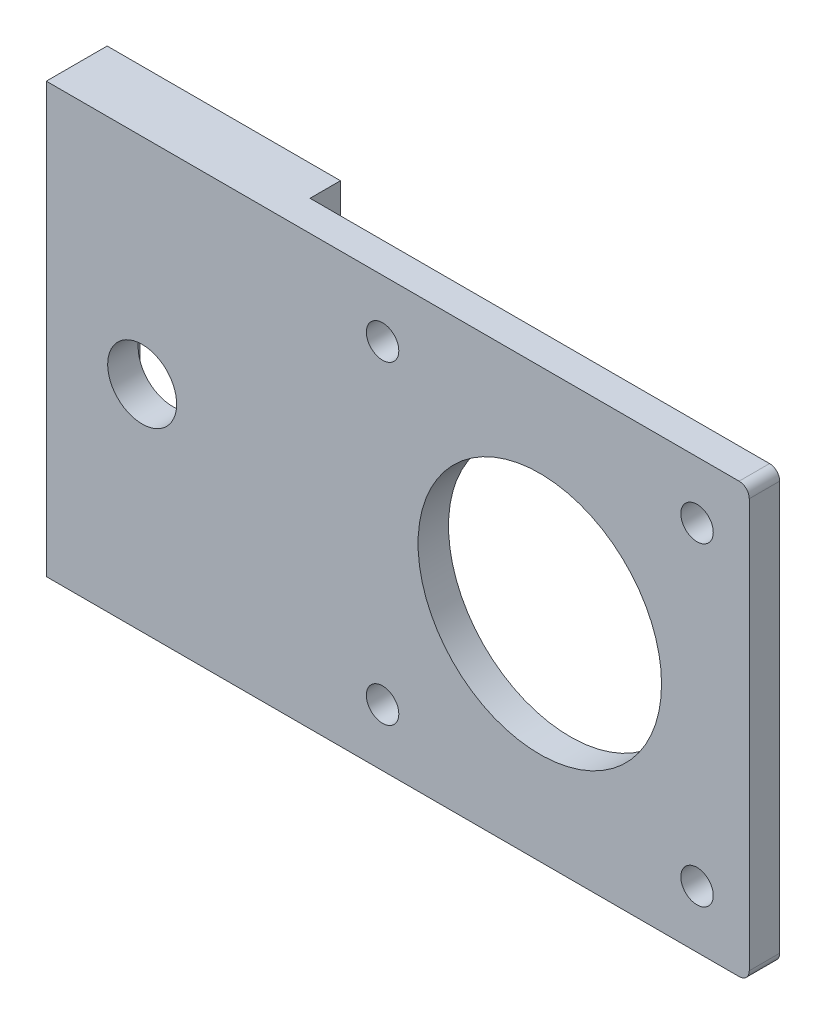
ISO-10303-21;
HEADER;
FILE_DESCRIPTION(('STEP AP214'),'2;1');
FILE_NAME('part.step','',(''),(''),'','','');
FILE_SCHEMA(('AUTOMOTIVE_DESIGN { 1 0 10303 214 1 1 1 1 }'));
ENDSEC;
DATA;
#1=APPLICATION_CONTEXT('core data for automotive mechanical design processes');
#2=APPLICATION_PROTOCOL_DEFINITION('international standard','automotive_design',2000,#1);
#3=PRODUCT_CONTEXT('',#1,'mechanical');
#4=PRODUCT('Part','Part','',(#3));
#5=PRODUCT_RELATED_PRODUCT_CATEGORY('part','',(#4));
#6=PRODUCT_DEFINITION_FORMATION('','',#4);
#7=PRODUCT_DEFINITION_CONTEXT('part definition',#1,'design');
#8=PRODUCT_DEFINITION('design','',#6,#7);
#9=PRODUCT_DEFINITION_SHAPE('','',#8);
#10=(LENGTH_UNIT() NAMED_UNIT(*) SI_UNIT(.MILLI.,.METRE.));
#11=(NAMED_UNIT(*) PLANE_ANGLE_UNIT() SI_UNIT($,.RADIAN.));
#12=(NAMED_UNIT(*) SI_UNIT($,.STERADIAN.) SOLID_ANGLE_UNIT());
#13=UNCERTAINTY_MEASURE_WITH_UNIT(LENGTH_MEASURE(1.E-05),#10,'distance_accuracy_value','');
#14=(GEOMETRIC_REPRESENTATION_CONTEXT(3) GLOBAL_UNCERTAINTY_ASSIGNED_CONTEXT((#13)) GLOBAL_UNIT_ASSIGNED_CONTEXT((#10,
#11,#12)) REPRESENTATION_CONTEXT('',''));
#15=CARTESIAN_POINT('',(0.,0.,0.));
#16=DIRECTION('',(0.,0.,1.));
#17=DIRECTION('',(1.,0.,0.));
#18=AXIS2_PLACEMENT_3D('',#15,#16,#17);
#19=CARTESIAN_POINT('',(0.,0.,3.));
#20=DIRECTION('',(0.,1.,0.));
#21=DIRECTION('',(0.,0.,1.));
#22=AXIS2_PLACEMENT_3D('',#19,#20,#21);
#23=PLANE('',#22);
#24=DIRECTION('',(1.,0.,0.));
#25=VECTOR('',#24,1.);
#26=CARTESIAN_POINT('',(0.,0.,0.));
#27=LINE('',#26,#25);
#28=CARTESIAN_POINT('',(-4.,0.,0.));
#29=VERTEX_POINT('',#28);
#30=CARTESIAN_POINT('',(41.3,0.,0.));
#31=VERTEX_POINT('',#30);
#32=EDGE_CURVE('E210',#29,#31,#27,.T.);
#33=ORIENTED_EDGE('',*,*,#32,.T.);
#34=DIRECTION('',(0.,0.,-1.));
#35=VECTOR('',#34,1.);
#36=CARTESIAN_POINT('',(41.3,0.,3.));
#37=LINE('',#36,#35);
#38=CARTESIAN_POINT('',(41.3,0.,3.));
#39=VERTEX_POINT('',#38);
#40=EDGE_CURVE('E11',#31,#39,#37,.F.);
#41=ORIENTED_EDGE('',*,*,#40,.T.);
#42=DIRECTION('',(-1.,0.,0.));
#43=VECTOR('',#42,1.);
#44=CARTESIAN_POINT('',(0.,0.,3.));
#45=LINE('',#44,#43);
#46=CARTESIAN_POINT('',(-27.,0.,3.00000000000001));
#47=VERTEX_POINT('',#46);
#48=EDGE_CURVE('E207',#39,#47,#45,.T.);
#49=ORIENTED_EDGE('',*,*,#48,.T.);
#50=DIRECTION('',(0.,0.,1.));
#51=VECTOR('',#50,1.);
#52=CARTESIAN_POINT('',(-27.,0.,3.00000000000001));
#53=LINE('',#52,#51);
#54=CARTESIAN_POINT('',(-27.,0.,-3.));
#55=VERTEX_POINT('',#54);
#56=EDGE_CURVE('E174',#55,#47,#53,.T.);
#57=ORIENTED_EDGE('',*,*,#56,.F.);
#58=DIRECTION('',(1.,0.,0.));
#59=VECTOR('',#58,1.);
#60=CARTESIAN_POINT('',(-7.,0.,-2.99999999999999));
#61=LINE('',#60,#59);
#62=CARTESIAN_POINT('',(-4.,0.,-2.99999999999999));
#63=VERTEX_POINT('',#62);
#64=EDGE_CURVE('E281',#55,#63,#61,.T.);
#65=ORIENTED_EDGE('',*,*,#64,.T.);
#66=DIRECTION('',(0.,0.,1.));
#67=VECTOR('',#66,1.);
#68=CARTESIAN_POINT('',(-4.,0.,3.));
#69=LINE('',#68,#67);
#70=EDGE_CURVE('E205',#63,#29,#69,.T.);
#71=ORIENTED_EDGE('',*,*,#70,.T.);
#72=EDGE_LOOP('',(#33,#41,#49,#57,#65,#71));
#73=FACE_BOUND('',#72,.T.);
#74=ADVANCED_FACE('F33',(#73),#23,.F.);
#75=CARTESIAN_POINT('',(42.3,0.,3.));
#76=DIRECTION('',(-1.,0.,0.));
#77=DIRECTION('',(0.,0.,1.));
#78=AXIS2_PLACEMENT_3D('',#75,#76,#77);
#79=PLANE('',#78);
#80=DIRECTION('',(0.,1.,0.));
#81=VECTOR('',#80,1.);
#82=CARTESIAN_POINT('',(42.3,0.,0.));
#83=LINE('',#82,#81);
#84=CARTESIAN_POINT('',(42.3,1.,0.));
#85=VERTEX_POINT('',#84);
#86=CARTESIAN_POINT('',(42.3,41.3,0.));
#87=VERTEX_POINT('',#86);
#88=EDGE_CURVE('E218',#85,#87,#83,.T.);
#89=ORIENTED_EDGE('',*,*,#88,.T.);
#90=DIRECTION('',(0.,0.,-1.));
#91=VECTOR('',#90,1.);
#92=CARTESIAN_POINT('',(42.3,41.3,3.));
#93=LINE('',#92,#91);
#94=CARTESIAN_POINT('',(42.3,41.3,3.));
#95=VERTEX_POINT('',#94);
#96=EDGE_CURVE('E251',#87,#95,#93,.F.);
#97=ORIENTED_EDGE('',*,*,#96,.T.);
#98=DIRECTION('',(0.,1.,0.));
#99=VECTOR('',#98,1.);
#100=CARTESIAN_POINT('',(42.3,0.,3.));
#101=LINE('',#100,#99);
#102=CARTESIAN_POINT('',(42.3,1.,3.));
#103=VERTEX_POINT('',#102);
#104=EDGE_CURVE('E212',#103,#95,#101,.T.);
#105=ORIENTED_EDGE('',*,*,#104,.F.);
#106=DIRECTION('',(0.,0.,-1.));
#107=VECTOR('',#106,1.);
#108=CARTESIAN_POINT('',(42.3,1.,3.));
#109=LINE('',#108,#107);
#110=EDGE_CURVE('E248',#103,#85,#109,.T.);
#111=ORIENTED_EDGE('',*,*,#110,.T.);
#112=EDGE_LOOP('',(#89,#97,#105,#111));
#113=FACE_BOUND('',#112,.T.);
#114=ADVANCED_FACE('F273',(#113),#79,.F.);
#115=CARTESIAN_POINT('',(0.,42.3,3.));
#116=DIRECTION('',(0.,1.,0.));
#117=DIRECTION('',(0.,0.,1.));
#118=AXIS2_PLACEMENT_3D('',#115,#116,#117);
#119=PLANE('',#118);
#120=DIRECTION('',(1.,0.,0.));
#121=VECTOR('',#120,1.);
#122=CARTESIAN_POINT('',(-7.00000000000001,42.3,-3.));
#123=LINE('',#122,#121);
#124=CARTESIAN_POINT('',(-27.,42.3,-3.00000000000001));
#125=VERTEX_POINT('',#124);
#126=CARTESIAN_POINT('',(-4.00000000000001,42.3,-3.));
#127=VERTEX_POINT('',#126);
#128=EDGE_CURVE('E224',#125,#127,#123,.T.);
#129=ORIENTED_EDGE('',*,*,#128,.F.);
#130=DIRECTION('',(0.,0.,-1.));
#131=VECTOR('',#130,1.);
#132=CARTESIAN_POINT('',(-27.,42.3,3.));
#133=LINE('',#132,#131);
#134=CARTESIAN_POINT('',(-27.,42.3,3.));
#135=VERTEX_POINT('',#134);
#136=EDGE_CURVE('E171',#135,#125,#133,.T.);
#137=ORIENTED_EDGE('',*,*,#136,.F.);
#138=DIRECTION('',(-1.,0.,0.));
#139=VECTOR('',#138,1.);
#140=CARTESIAN_POINT('',(0.,42.3,3.));
#141=LINE('',#140,#139);
#142=CARTESIAN_POINT('',(41.3,42.3,3.));
#143=VERTEX_POINT('',#142);
#144=EDGE_CURVE('E209',#143,#135,#141,.T.);
#145=ORIENTED_EDGE('',*,*,#144,.F.);
#146=DIRECTION('',(0.,0.,-1.));
#147=VECTOR('',#146,1.);
#148=CARTESIAN_POINT('',(41.3,42.3,0.));
#149=LINE('',#148,#147);
#150=CARTESIAN_POINT('',(41.3,42.3,0.));
#151=VERTEX_POINT('',#150);
#152=EDGE_CURVE('E215',#143,#151,#149,.T.);
#153=ORIENTED_EDGE('',*,*,#152,.T.);
#154=DIRECTION('',(1.,0.,0.));
#155=VECTOR('',#154,1.);
#156=CARTESIAN_POINT('',(0.,42.3,0.));
#157=LINE('',#156,#155);
#158=CARTESIAN_POINT('',(-4.00000000000001,42.3,0.));
#159=VERTEX_POINT('',#158);
#160=EDGE_CURVE('E223',#159,#151,#157,.T.);
#161=ORIENTED_EDGE('',*,*,#160,.F.);
#162=DIRECTION('',(0.,0.,-1.));
#163=VECTOR('',#162,1.);
#164=CARTESIAN_POINT('',(-4.00000000000001,42.3,3.));
#165=LINE('',#164,#163);
#166=EDGE_CURVE('E202',#159,#127,#165,.T.);
#167=ORIENTED_EDGE('',*,*,#166,.T.);
#168=EDGE_LOOP('',(#129,#137,#145,#153,#161,#167));
#169=FACE_BOUND('',#168,.T.);
#170=ADVANCED_FACE('F265',(#169),#119,.T.);
#171=CARTESIAN_POINT('',(0.,0.,3.));
#172=DIRECTION('',(0.,0.,1.));
#173=DIRECTION('',(1.,0.,0.));
#174=AXIS2_PLACEMENT_3D('',#171,#172,#173);
#175=PLANE('',#174);
#176=CARTESIAN_POINT('',(-17.55,21.15,3.00000000000001));
#177=DIRECTION('',(0.,0.,-1.));
#178=DIRECTION('',(0.,1.,0.));
#179=AXIS2_PLACEMENT_3D('',#176,#177,#178);
#180=CIRCLE('',#179,3.4);
#181=CARTESIAN_POINT('',(-17.55,24.55,3.00000000000001));
#182=VERTEX_POINT('',#181);
#183=EDGE_CURVE('E165',#182,#182,#180,.T.);
#184=ORIENTED_EDGE('',*,*,#183,.T.);
#185=EDGE_LOOP('',(#184));
#186=FACE_BOUND('',#185,.T.);
#187=CARTESIAN_POINT('',(37.15,36.65,3.));
#188=DIRECTION('',(0.,0.,1.));
#189=DIRECTION('',(1.,0.,0.));
#190=AXIS2_PLACEMENT_3D('',#187,#188,#189);
#191=CIRCLE('',#190,1.6);
#192=CARTESIAN_POINT('',(38.75,36.65,3.));
#193=VERTEX_POINT('',#192);
#194=EDGE_CURVE('E177',#193,#193,#191,.T.);
#195=ORIENTED_EDGE('',*,*,#194,.F.);
#196=EDGE_LOOP('',(#195));
#197=FACE_BOUND('',#196,.T.);
#198=CARTESIAN_POINT('',(37.15,5.65,3.));
#199=DIRECTION('',(0.,0.,1.));
#200=DIRECTION('',(1.,0.,0.));
#201=AXIS2_PLACEMENT_3D('',#198,#199,#200);
#202=CIRCLE('',#201,1.6);
#203=CARTESIAN_POINT('',(38.75,5.65,3.));
#204=VERTEX_POINT('',#203);
#205=EDGE_CURVE('E181',#204,#204,#202,.T.);
#206=ORIENTED_EDGE('',*,*,#205,.F.);
#207=EDGE_LOOP('',(#206));
#208=FACE_BOUND('',#207,.T.);
#209=CARTESIAN_POINT('',(6.15,5.65000000000001,3.));
#210=DIRECTION('',(0.,0.,1.));
#211=DIRECTION('',(1.,0.,0.));
#212=AXIS2_PLACEMENT_3D('',#209,#210,#211);
#213=CIRCLE('',#212,1.6);
#214=CARTESIAN_POINT('',(7.75,5.65000000000001,3.));
#215=VERTEX_POINT('',#214);
#216=EDGE_CURVE('E185',#215,#215,#213,.T.);
#217=ORIENTED_EDGE('',*,*,#216,.F.);
#218=EDGE_LOOP('',(#217));
#219=FACE_BOUND('',#218,.T.);
#220=CARTESIAN_POINT('',(21.65,21.15,3.));
#221=DIRECTION('',(0.,0.,1.));
#222=DIRECTION('',(1.,0.,0.));
#223=AXIS2_PLACEMENT_3D('',#220,#221,#222);
#224=CIRCLE('',#223,12.);
#225=CARTESIAN_POINT('',(33.65,21.15,3.));
#226=VERTEX_POINT('',#225);
#227=EDGE_CURVE('E189',#226,#226,#224,.T.);
#228=ORIENTED_EDGE('',*,*,#227,.F.);
#229=EDGE_LOOP('',(#228));
#230=FACE_BOUND('',#229,.T.);
#231=CARTESIAN_POINT('',(6.15,36.65,3.));
#232=DIRECTION('',(0.,0.,1.));
#233=DIRECTION('',(1.,0.,0.));
#234=AXIS2_PLACEMENT_3D('',#231,#232,#233);
#235=CIRCLE('',#234,1.6);
#236=CARTESIAN_POINT('',(7.74999999999999,36.65,3.));
#237=VERTEX_POINT('',#236);
#238=EDGE_CURVE('E193',#237,#237,#235,.T.);
#239=ORIENTED_EDGE('',*,*,#238,.F.);
#240=EDGE_LOOP('',(#239));
#241=FACE_BOUND('',#240,.T.);
#242=ORIENTED_EDGE('',*,*,#104,.T.);
#243=CARTESIAN_POINT('',(41.3,41.3,3.));
#244=DIRECTION('',(0.,0.,1.));
#245=DIRECTION('',(1.,0.,0.));
#246=AXIS2_PLACEMENT_3D('',#243,#244,#245);
#247=CIRCLE('',#246,1.);
#248=EDGE_CURVE('E41',#95,#143,#247,.T.);
#249=ORIENTED_EDGE('',*,*,#248,.T.);
#250=ORIENTED_EDGE('',*,*,#144,.T.);
#251=DIRECTION('',(0.,1.,0.));
#252=VECTOR('',#251,1.);
#253=CARTESIAN_POINT('',(-27.,42.3,3.));
#254=LINE('',#253,#252);
#255=EDGE_CURVE('E168',#47,#135,#254,.T.);
#256=ORIENTED_EDGE('',*,*,#255,.F.);
#257=ORIENTED_EDGE('',*,*,#48,.F.);
#258=CARTESIAN_POINT('',(41.3,1.,3.));
#259=DIRECTION('',(0.,0.,1.));
#260=DIRECTION('',(1.,0.,0.));
#261=AXIS2_PLACEMENT_3D('',#258,#259,#260);
#262=CIRCLE('',#261,1.);
#263=EDGE_CURVE('E253',#39,#103,#262,.T.);
#264=ORIENTED_EDGE('',*,*,#263,.T.);
#265=EDGE_LOOP('',(#242,#249,#250,#256,#257,#264));
#266=FACE_BOUND('',#265,.T.);
#267=ADVANCED_FACE('F257',(#186,#197,#208,#219,#230,#241,#266),#175,.T.);
#268=CARTESIAN_POINT('',(0.,0.,0.));
#269=DIRECTION('',(0.,0.,1.));
#270=DIRECTION('',(1.,0.,0.));
#271=AXIS2_PLACEMENT_3D('',#268,#269,#270);
#272=PLANE('',#271);
#273=CARTESIAN_POINT('',(37.15,36.65,0.));
#274=DIRECTION('',(0.,0.,1.));
#275=DIRECTION('',(1.,0.,0.));
#276=AXIS2_PLACEMENT_3D('',#273,#274,#275);
#277=CIRCLE('',#276,1.6);
#278=CARTESIAN_POINT('',(38.75,36.65,0.));
#279=VERTEX_POINT('',#278);
#280=EDGE_CURVE('E180',#279,#279,#277,.T.);
#281=ORIENTED_EDGE('',*,*,#280,.T.);
#282=EDGE_LOOP('',(#281));
#283=FACE_BOUND('',#282,.T.);
#284=CARTESIAN_POINT('',(37.15,5.65,0.));
#285=DIRECTION('',(0.,0.,1.));
#286=DIRECTION('',(1.,0.,0.));
#287=AXIS2_PLACEMENT_3D('',#284,#285,#286);
#288=CIRCLE('',#287,1.6);
#289=CARTESIAN_POINT('',(38.75,5.65,0.));
#290=VERTEX_POINT('',#289);
#291=EDGE_CURVE('E184',#290,#290,#288,.T.);
#292=ORIENTED_EDGE('',*,*,#291,.T.);
#293=EDGE_LOOP('',(#292));
#294=FACE_BOUND('',#293,.T.);
#295=CARTESIAN_POINT('',(6.15,5.65000000000001,0.));
#296=DIRECTION('',(0.,0.,1.));
#297=DIRECTION('',(1.,0.,0.));
#298=AXIS2_PLACEMENT_3D('',#295,#296,#297);
#299=CIRCLE('',#298,1.6);
#300=CARTESIAN_POINT('',(7.75,5.65000000000001,0.));
#301=VERTEX_POINT('',#300);
#302=EDGE_CURVE('E188',#301,#301,#299,.T.);
#303=ORIENTED_EDGE('',*,*,#302,.T.);
#304=EDGE_LOOP('',(#303));
#305=FACE_BOUND('',#304,.T.);
#306=CARTESIAN_POINT('',(21.65,21.15,0.));
#307=DIRECTION('',(0.,0.,1.));
#308=DIRECTION('',(1.,0.,0.));
#309=AXIS2_PLACEMENT_3D('',#306,#307,#308);
#310=CIRCLE('',#309,12.);
#311=CARTESIAN_POINT('',(33.65,21.15,0.));
#312=VERTEX_POINT('',#311);
#313=EDGE_CURVE('E192',#312,#312,#310,.T.);
#314=ORIENTED_EDGE('',*,*,#313,.T.);
#315=EDGE_LOOP('',(#314));
#316=FACE_BOUND('',#315,.T.);
#317=CARTESIAN_POINT('',(6.15,36.65,0.));
#318=DIRECTION('',(0.,0.,1.));
#319=DIRECTION('',(1.,0.,0.));
#320=AXIS2_PLACEMENT_3D('',#317,#318,#319);
#321=CIRCLE('',#320,1.6);
#322=CARTESIAN_POINT('',(7.74999999999999,36.65,0.));
#323=VERTEX_POINT('',#322);
#324=EDGE_CURVE('E196',#323,#323,#321,.T.);
#325=ORIENTED_EDGE('',*,*,#324,.T.);
#326=EDGE_LOOP('',(#325));
#327=FACE_BOUND('',#326,.T.);
#328=ORIENTED_EDGE('',*,*,#160,.T.);
#329=CARTESIAN_POINT('',(41.3,41.3,0.));
#330=DIRECTION('',(0.,0.,1.));
#331=DIRECTION('',(1.,0.,0.));
#332=AXIS2_PLACEMENT_3D('',#329,#330,#331);
#333=CIRCLE('',#332,1.);
#334=EDGE_CURVE('E246',#151,#87,#333,.F.);
#335=ORIENTED_EDGE('',*,*,#334,.T.);
#336=ORIENTED_EDGE('',*,*,#88,.F.);
#337=CARTESIAN_POINT('',(41.3,1.,0.));
#338=DIRECTION('',(0.,0.,1.));
#339=DIRECTION('',(1.,0.,0.));
#340=AXIS2_PLACEMENT_3D('',#337,#338,#339);
#341=CIRCLE('',#340,1.);
#342=EDGE_CURVE('E244',#85,#31,#341,.F.);
#343=ORIENTED_EDGE('',*,*,#342,.T.);
#344=ORIENTED_EDGE('',*,*,#32,.F.);
#345=DIRECTION('',(0.,-1.,0.));
#346=VECTOR('',#345,1.);
#347=CARTESIAN_POINT('',(-4.00000000000001,42.3,0.));
#348=LINE('',#347,#346);
#349=EDGE_CURVE('E220',#159,#29,#348,.T.);
#350=ORIENTED_EDGE('',*,*,#349,.F.);
#351=EDGE_LOOP('',(#328,#335,#336,#343,#344,#350));
#352=FACE_BOUND('',#351,.T.);
#353=ADVANCED_FACE('F270',(#283,#294,#305,#316,#327,#352),#272,.F.);
#354=CARTESIAN_POINT('',(-7.00000000000001,42.3,-3.));
#355=DIRECTION('',(0.,0.,1.));
#356=DIRECTION('',(0.,-1.,0.));
#357=AXIS2_PLACEMENT_3D('',#354,#355,#356);
#358=PLANE('',#357);
#359=DIRECTION('',(1.,0.,0.));
#360=VECTOR('',#359,1.);
#361=CARTESIAN_POINT('',(-23.75,27.8,-3.));
#362=LINE('',#361,#360);
#363=CARTESIAN_POINT('',(-23.75,27.8,-3.));
#364=VERTEX_POINT('',#363);
#365=CARTESIAN_POINT('',(-11.35,27.8,-3.));
#366=VERTEX_POINT('',#365);
#367=EDGE_CURVE('E150',#364,#366,#362,.T.);
#368=ORIENTED_EDGE('',*,*,#367,.F.);
#369=DIRECTION('',(0.,1.,0.));
#370=VECTOR('',#369,1.);
#371=CARTESIAN_POINT('',(-23.75,14.5,-3.));
#372=LINE('',#371,#370);
#373=CARTESIAN_POINT('',(-23.75,14.5,-3.));
#374=VERTEX_POINT('',#373);
#375=EDGE_CURVE('E48',#374,#364,#372,.T.);
#376=ORIENTED_EDGE('',*,*,#375,.F.);
#377=DIRECTION('',(1.,0.,0.));
#378=VECTOR('',#377,1.);
#379=CARTESIAN_POINT('',(-23.75,14.5,-3.));
#380=LINE('',#379,#378);
#381=CARTESIAN_POINT('',(-11.35,14.5,-3.));
#382=VERTEX_POINT('',#381);
#383=EDGE_CURVE('E141',#374,#382,#380,.T.);
#384=ORIENTED_EDGE('',*,*,#383,.T.);
#385=DIRECTION('',(0.,1.,0.));
#386=VECTOR('',#385,1.);
#387=CARTESIAN_POINT('',(-11.35,14.5,-3.));
#388=LINE('',#387,#386);
#389=EDGE_CURVE('E144',#382,#366,#388,.T.);
#390=ORIENTED_EDGE('',*,*,#389,.T.);
#391=EDGE_LOOP('',(#368,#376,#384,#390));
#392=FACE_BOUND('',#391,.T.);
#393=DIRECTION('',(0.,-1.,0.));
#394=VECTOR('',#393,1.);
#395=CARTESIAN_POINT('',(-4.00000000000001,42.3,-3.));
#396=LINE('',#395,#394);
#397=EDGE_CURVE('E199',#127,#63,#396,.T.);
#398=ORIENTED_EDGE('',*,*,#397,.T.);
#399=ORIENTED_EDGE('',*,*,#64,.F.);
#400=DIRECTION('',(0.,1.,0.));
#401=VECTOR('',#400,1.);
#402=CARTESIAN_POINT('',(-27.,0.,-3.));
#403=LINE('',#402,#401);
#404=EDGE_CURVE('E162',#55,#125,#403,.T.);
#405=ORIENTED_EDGE('',*,*,#404,.T.);
#406=ORIENTED_EDGE('',*,*,#128,.T.);
#407=EDGE_LOOP('',(#398,#399,#405,#406));
#408=FACE_BOUND('',#407,.T.);
#409=ADVANCED_FACE('F287',(#392,#408),#358,.F.);
#410=CARTESIAN_POINT('',(-4.,0.,0.));
#411=DIRECTION('',(1.,0.,0.));
#412=DIRECTION('',(0.,1.,0.));
#413=AXIS2_PLACEMENT_3D('',#410,#411,#412);
#414=PLANE('',#413);
#415=ORIENTED_EDGE('',*,*,#166,.F.);
#416=ORIENTED_EDGE('',*,*,#349,.T.);
#417=ORIENTED_EDGE('',*,*,#70,.F.);
#418=ORIENTED_EDGE('',*,*,#397,.F.);
#419=EDGE_LOOP('',(#415,#416,#417,#418));
#420=FACE_BOUND('',#419,.T.);
#421=ADVANCED_FACE('F289',(#420),#414,.T.);
#422=CARTESIAN_POINT('',(6.15,36.65,-3.000025));
#423=DIRECTION('',(0.,0.,1.));
#424=DIRECTION('',(1.,0.,0.));
#425=AXIS2_PLACEMENT_3D('',#422,#423,#424);
#426=CYLINDRICAL_SURFACE('',#425,1.6);
#427=ORIENTED_EDGE('',*,*,#238,.T.);
#428=EDGE_LOOP('',(#427));
#429=FACE_BOUND('',#428,.T.);
#430=ORIENTED_EDGE('',*,*,#324,.F.);
#431=EDGE_LOOP('',(#430));
#432=FACE_BOUND('',#431,.T.);
#433=ADVANCED_FACE('F329',(#429,#432),#426,.F.);
#434=CARTESIAN_POINT('',(21.65,21.15,-3.000025));
#435=DIRECTION('',(0.,0.,1.));
#436=DIRECTION('',(1.,0.,0.));
#437=AXIS2_PLACEMENT_3D('',#434,#435,#436);
#438=CYLINDRICAL_SURFACE('',#437,12.);
#439=ORIENTED_EDGE('',*,*,#227,.T.);
#440=EDGE_LOOP('',(#439));
#441=FACE_BOUND('',#440,.T.);
#442=ORIENTED_EDGE('',*,*,#313,.F.);
#443=EDGE_LOOP('',(#442));
#444=FACE_BOUND('',#443,.T.);
#445=ADVANCED_FACE('F332',(#441,#444),#438,.F.);
#446=CARTESIAN_POINT('',(6.15,5.65000000000001,-3.000025));
#447=DIRECTION('',(0.,0.,1.));
#448=DIRECTION('',(1.,0.,0.));
#449=AXIS2_PLACEMENT_3D('',#446,#447,#448);
#450=CYLINDRICAL_SURFACE('',#449,1.6);
#451=ORIENTED_EDGE('',*,*,#216,.T.);
#452=EDGE_LOOP('',(#451));
#453=FACE_BOUND('',#452,.T.);
#454=ORIENTED_EDGE('',*,*,#302,.F.);
#455=EDGE_LOOP('',(#454));
#456=FACE_BOUND('',#455,.T.);
#457=ADVANCED_FACE('F336',(#453,#456),#450,.F.);
#458=CARTESIAN_POINT('',(37.15,5.65,-3.000025));
#459=DIRECTION('',(0.,0.,1.));
#460=DIRECTION('',(1.,0.,0.));
#461=AXIS2_PLACEMENT_3D('',#458,#459,#460);
#462=CYLINDRICAL_SURFACE('',#461,1.6);
#463=ORIENTED_EDGE('',*,*,#205,.T.);
#464=EDGE_LOOP('',(#463));
#465=FACE_BOUND('',#464,.T.);
#466=ORIENTED_EDGE('',*,*,#291,.F.);
#467=EDGE_LOOP('',(#466));
#468=FACE_BOUND('',#467,.T.);
#469=ADVANCED_FACE('F300',(#465,#468),#462,.F.);
#470=CARTESIAN_POINT('',(37.15,36.65,-3.000025));
#471=DIRECTION('',(0.,0.,1.));
#472=DIRECTION('',(1.,0.,0.));
#473=AXIS2_PLACEMENT_3D('',#470,#471,#472);
#474=CYLINDRICAL_SURFACE('',#473,1.6);
#475=ORIENTED_EDGE('',*,*,#194,.T.);
#476=EDGE_LOOP('',(#475));
#477=FACE_BOUND('',#476,.T.);
#478=ORIENTED_EDGE('',*,*,#280,.F.);
#479=EDGE_LOOP('',(#478));
#480=FACE_BOUND('',#479,.T.);
#481=ADVANCED_FACE('F294',(#477,#480),#474,.F.);
#482=CARTESIAN_POINT('',(-27.,0.,0.));
#483=DIRECTION('',(1.,0.,0.));
#484=DIRECTION('',(0.,1.,0.));
#485=AXIS2_PLACEMENT_3D('',#482,#483,#484);
#486=PLANE('',#485);
#487=ORIENTED_EDGE('',*,*,#255,.T.);
#488=ORIENTED_EDGE('',*,*,#136,.T.);
#489=ORIENTED_EDGE('',*,*,#404,.F.);
#490=ORIENTED_EDGE('',*,*,#56,.T.);
#491=EDGE_LOOP('',(#487,#488,#489,#490));
#492=FACE_BOUND('',#491,.T.);
#493=ADVANCED_FACE('F292',(#492),#486,.F.);
#494=CARTESIAN_POINT('',(41.3,41.3,3.));
#495=DIRECTION('',(0.,0.,1.));
#496=DIRECTION('',(1.,0.,0.));
#497=AXIS2_PLACEMENT_3D('',#494,#495,#496);
#498=CYLINDRICAL_SURFACE('',#497,1.);
#499=ORIENTED_EDGE('',*,*,#248,.F.);
#500=ORIENTED_EDGE('',*,*,#96,.F.);
#501=ORIENTED_EDGE('',*,*,#334,.F.);
#502=ORIENTED_EDGE('',*,*,#152,.F.);
#503=EDGE_LOOP('',(#499,#500,#501,#502));
#504=FACE_BOUND('',#503,.T.);
#505=ADVANCED_FACE('F266',(#504),#498,.T.);
#506=CARTESIAN_POINT('',(41.3,1.,3.));
#507=DIRECTION('',(0.,0.,-1.));
#508=DIRECTION('',(-1.,0.,0.));
#509=AXIS2_PLACEMENT_3D('',#506,#507,#508);
#510=CYLINDRICAL_SURFACE('',#509,1.);
#511=ORIENTED_EDGE('',*,*,#263,.F.);
#512=ORIENTED_EDGE('',*,*,#40,.F.);
#513=ORIENTED_EDGE('',*,*,#342,.F.);
#514=ORIENTED_EDGE('',*,*,#110,.F.);
#515=EDGE_LOOP('',(#511,#512,#513,#514));
#516=FACE_BOUND('',#515,.T.);
#517=ADVANCED_FACE('F35',(#516),#510,.T.);
#518=CARTESIAN_POINT('',(-17.55,21.15,3.00000000000001));
#519=DIRECTION('',(0.,0.,-1.));
#520=DIRECTION('',(0.,1.,0.));
#521=AXIS2_PLACEMENT_3D('',#518,#519,#520);
#522=CYLINDRICAL_SURFACE('',#521,3.4);
#523=ORIENTED_EDGE('',*,*,#183,.F.);
#524=EDGE_LOOP('',(#523));
#525=FACE_BOUND('',#524,.T.);
#526=CARTESIAN_POINT('',(-17.55,21.15,0.));
#527=DIRECTION('',(0.,0.,-1.));
#528=DIRECTION('',(0.,1.,0.));
#529=AXIS2_PLACEMENT_3D('',#526,#527,#528);
#530=CIRCLE('',#529,3.4);
#531=CARTESIAN_POINT('',(-17.55,24.55,0.));
#532=VERTEX_POINT('',#531);
#533=EDGE_CURVE('E156',#532,#532,#530,.F.);
#534=ORIENTED_EDGE('',*,*,#533,.F.);
#535=EDGE_LOOP('',(#534));
#536=FACE_BOUND('',#535,.T.);
#537=ADVANCED_FACE('F404',(#525,#536),#522,.F.);
#538=CARTESIAN_POINT('',(0.,0.,0.));
#539=DIRECTION('',(0.,0.,-1.));
#540=DIRECTION('',(0.,1.,0.));
#541=AXIS2_PLACEMENT_3D('',#538,#539,#540);
#542=PLANE('',#541);
#543=DIRECTION('',(0.,1.,0.));
#544=VECTOR('',#543,1.);
#545=CARTESIAN_POINT('',(-23.75,14.5,0.));
#546=LINE('',#545,#544);
#547=CARTESIAN_POINT('',(-23.75,14.5,0.));
#548=VERTEX_POINT('',#547);
#549=CARTESIAN_POINT('',(-23.75,27.8,0.));
#550=VERTEX_POINT('',#549);
#551=EDGE_CURVE('E123',#548,#550,#546,.T.);
#552=ORIENTED_EDGE('',*,*,#551,.T.);
#553=DIRECTION('',(1.,0.,0.));
#554=VECTOR('',#553,1.);
#555=CARTESIAN_POINT('',(-23.75,27.8,0.));
#556=LINE('',#555,#554);
#557=CARTESIAN_POINT('',(-11.35,27.8,0.));
#558=VERTEX_POINT('',#557);
#559=EDGE_CURVE('E132',#550,#558,#556,.T.);
#560=ORIENTED_EDGE('',*,*,#559,.T.);
#561=DIRECTION('',(0.,1.,0.));
#562=VECTOR('',#561,1.);
#563=CARTESIAN_POINT('',(-11.35,14.5,0.));
#564=LINE('',#563,#562);
#565=CARTESIAN_POINT('',(-11.35,14.5,0.));
#566=VERTEX_POINT('',#565);
#567=EDGE_CURVE('E136',#566,#558,#564,.T.);
#568=ORIENTED_EDGE('',*,*,#567,.F.);
#569=DIRECTION('',(1.,0.,0.));
#570=VECTOR('',#569,1.);
#571=CARTESIAN_POINT('',(-23.75,14.5,0.));
#572=LINE('',#571,#570);
#573=EDGE_CURVE('E128',#548,#566,#572,.T.);
#574=ORIENTED_EDGE('',*,*,#573,.F.);
#575=EDGE_LOOP('',(#552,#560,#568,#574));
#576=FACE_BOUND('',#575,.T.);
#577=ORIENTED_EDGE('',*,*,#533,.T.);
#578=EDGE_LOOP('',(#577));
#579=FACE_BOUND('',#578,.T.);
#580=ADVANCED_FACE('F139',(#576,#579),#542,.T.);
#581=CARTESIAN_POINT('',(-23.75,14.5,0.));
#582=DIRECTION('',(-1.,0.,0.));
#583=DIRECTION('',(0.,0.,1.));
#584=AXIS2_PLACEMENT_3D('',#581,#582,#583);
#585=PLANE('',#584);
#586=ORIENTED_EDGE('',*,*,#375,.T.);
#587=DIRECTION('',(0.,0.,-1.));
#588=VECTOR('',#587,1.);
#589=CARTESIAN_POINT('',(-23.75,27.8,0.));
#590=LINE('',#589,#588);
#591=EDGE_CURVE('E119',#550,#364,#590,.T.);
#592=ORIENTED_EDGE('',*,*,#591,.F.);
#593=ORIENTED_EDGE('',*,*,#551,.F.);
#594=DIRECTION('',(0.,0.,-1.));
#595=VECTOR('',#594,1.);
#596=CARTESIAN_POINT('',(-23.75,14.5,0.));
#597=LINE('',#596,#595);
#598=EDGE_CURVE('E154',#548,#374,#597,.T.);
#599=ORIENTED_EDGE('',*,*,#598,.T.);
#600=EDGE_LOOP('',(#586,#592,#593,#599));
#601=FACE_BOUND('',#600,.T.);
#602=ADVANCED_FACE('F121',(#601),#585,.F.);
#603=CARTESIAN_POINT('',(-23.75,14.5,0.));
#604=DIRECTION('',(0.,1.,0.));
#605=DIRECTION('',(-1.,0.,0.));
#606=AXIS2_PLACEMENT_3D('',#603,#604,#605);
#607=PLANE('',#606);
#608=ORIENTED_EDGE('',*,*,#383,.F.);
#609=ORIENTED_EDGE('',*,*,#598,.F.);
#610=ORIENTED_EDGE('',*,*,#573,.T.);
#611=DIRECTION('',(0.,0.,-1.));
#612=VECTOR('',#611,1.);
#613=CARTESIAN_POINT('',(-11.35,14.5,0.));
#614=LINE('',#613,#612);
#615=EDGE_CURVE('E157',#566,#382,#614,.T.);
#616=ORIENTED_EDGE('',*,*,#615,.T.);
#617=EDGE_LOOP('',(#608,#609,#610,#616));
#618=FACE_BOUND('',#617,.T.);
#619=ADVANCED_FACE('F450',(#618),#607,.T.);
#620=CARTESIAN_POINT('',(-11.35,14.5,0.));
#621=DIRECTION('',(-1.,0.,0.));
#622=DIRECTION('',(0.,0.,1.));
#623=AXIS2_PLACEMENT_3D('',#620,#621,#622);
#624=PLANE('',#623);
#625=ORIENTED_EDGE('',*,*,#389,.F.);
#626=ORIENTED_EDGE('',*,*,#615,.F.);
#627=ORIENTED_EDGE('',*,*,#567,.T.);
#628=DIRECTION('',(0.,0.,-1.));
#629=VECTOR('',#628,1.);
#630=CARTESIAN_POINT('',(-11.35,27.8,0.));
#631=LINE('',#630,#629);
#632=EDGE_CURVE('E127',#558,#366,#631,.T.);
#633=ORIENTED_EDGE('',*,*,#632,.T.);
#634=EDGE_LOOP('',(#625,#626,#627,#633));
#635=FACE_BOUND('',#634,.T.);
#636=ADVANCED_FACE('F459',(#635),#624,.T.);
#637=CARTESIAN_POINT('',(-23.75,27.8,0.));
#638=DIRECTION('',(0.,1.,0.));
#639=DIRECTION('',(0.,0.,1.));
#640=AXIS2_PLACEMENT_3D('',#637,#638,#639);
#641=PLANE('',#640);
#642=ORIENTED_EDGE('',*,*,#367,.T.);
#643=ORIENTED_EDGE('',*,*,#632,.F.);
#644=ORIENTED_EDGE('',*,*,#559,.F.);
#645=ORIENTED_EDGE('',*,*,#591,.T.);
#646=EDGE_LOOP('',(#642,#643,#644,#645));
#647=FACE_BOUND('',#646,.T.);
#648=ADVANCED_FACE('F133',(#647),#641,.F.);
#649=CLOSED_SHELL('',(#74,#114,#170,#267,#353,#409,#421,#433,#445,#457,#469,#481,#493,#505,#517,
#537,#580,#602,#619,#636,#648));
#650=MANIFOLD_SOLID_BREP('B2',#649);
#651=ADVANCED_BREP_SHAPE_REPRESENTATION('',(#18,#650),#14);
#652=SHAPE_DEFINITION_REPRESENTATION(#9,#651);
ENDSEC;
END-ISO-10303-21;
